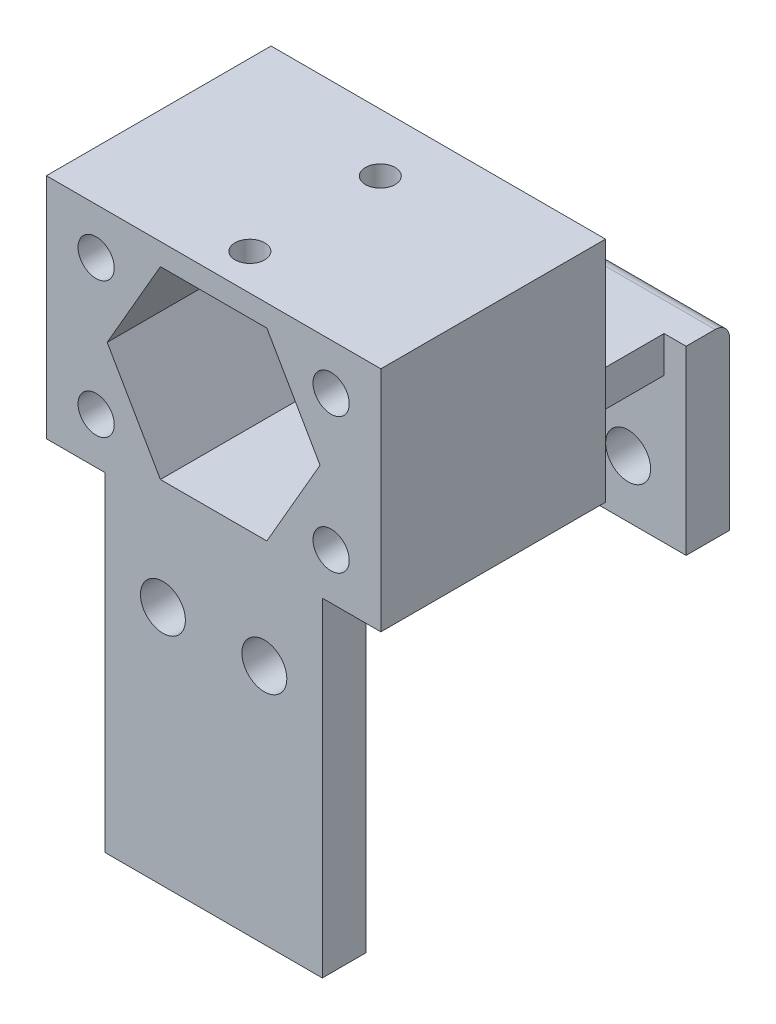
ISO-10303-21;
HEADER;
FILE_DESCRIPTION(('STEP AP214'),'2;1');
FILE_NAME('part.step','',(''),(''),'','','');
FILE_SCHEMA(('AUTOMOTIVE_DESIGN { 1 0 10303 214 1 1 1 1 }'));
ENDSEC;
DATA;
#1=APPLICATION_CONTEXT('core data for automotive mechanical design processes');
#2=APPLICATION_PROTOCOL_DEFINITION('international standard','automotive_design',2000,#1);
#3=PRODUCT_CONTEXT('',#1,'mechanical');
#4=PRODUCT('Part','Part','',(#3));
#5=PRODUCT_RELATED_PRODUCT_CATEGORY('part','',(#4));
#6=PRODUCT_DEFINITION_FORMATION('','',#4);
#7=PRODUCT_DEFINITION_CONTEXT('part definition',#1,'design');
#8=PRODUCT_DEFINITION('design','',#6,#7);
#9=PRODUCT_DEFINITION_SHAPE('','',#8);
#10=(LENGTH_UNIT() NAMED_UNIT(*) SI_UNIT(.MILLI.,.METRE.));
#11=(NAMED_UNIT(*) PLANE_ANGLE_UNIT() SI_UNIT($,.RADIAN.));
#12=(NAMED_UNIT(*) SI_UNIT($,.STERADIAN.) SOLID_ANGLE_UNIT());
#13=UNCERTAINTY_MEASURE_WITH_UNIT(LENGTH_MEASURE(1.E-05),#10,'distance_accuracy_value','');
#14=(GEOMETRIC_REPRESENTATION_CONTEXT(3) GLOBAL_UNCERTAINTY_ASSIGNED_CONTEXT((#13)) GLOBAL_UNIT_ASSIGNED_CONTEXT((#10,
#11,#12)) REPRESENTATION_CONTEXT('',''));
#15=CARTESIAN_POINT('',(0.,0.,0.));
#16=DIRECTION('',(0.,0.,1.));
#17=DIRECTION('',(1.,0.,0.));
#18=AXIS2_PLACEMENT_3D('',#15,#16,#17);
#19=CARTESIAN_POINT('',(0.,0.,-1.5));
#20=DIRECTION('',(0.,0.,-1.));
#21=DIRECTION('',(-1.,0.,0.));
#22=AXIS2_PLACEMENT_3D('',#19,#20,#21);
#23=PLANE('',#22);
#24=CARTESIAN_POINT('',(-8.10599777942234,-4.68,-1.5));
#25=DIRECTION('',(0.,0.,-1.));
#26=DIRECTION('',(-1.,0.,0.));
#27=AXIS2_PLACEMENT_3D('',#24,#25,#26);
#28=CIRCLE('',#27,1.24999999999999);
#29=CARTESIAN_POINT('',(-9.35599777942234,-4.68,-1.5));
#30=VERTEX_POINT('',#29);
#31=EDGE_CURVE('E260',#30,#30,#28,.F.);
#32=ORIENTED_EDGE('',*,*,#31,.T.);
#33=EDGE_LOOP('',(#32));
#34=FACE_BOUND('',#33,.T.);
#35=CARTESIAN_POINT('',(8.10599777942235,-4.68,-1.5));
#36=DIRECTION('',(0.,0.,-1.));
#37=DIRECTION('',(-1.,0.,0.));
#38=AXIS2_PLACEMENT_3D('',#35,#36,#37);
#39=CIRCLE('',#38,1.24999999999999);
#40=CARTESIAN_POINT('',(6.85599777942235,-4.68,-1.5));
#41=VERTEX_POINT('',#40);
#42=EDGE_CURVE('E276',#41,#41,#39,.F.);
#43=ORIENTED_EDGE('',*,*,#42,.T.);
#44=EDGE_LOOP('',(#43));
#45=FACE_BOUND('',#44,.T.);
#46=CARTESIAN_POINT('',(0.,0.,-1.5));
#47=DIRECTION('',(0.,0.,-1.));
#48=DIRECTION('',(-1.,0.,0.));
#49=AXIS2_PLACEMENT_3D('',#46,#47,#48);
#50=CIRCLE('',#49,4.75);
#51=CARTESIAN_POINT('',(-4.75,0.,-1.5));
#52=VERTEX_POINT('',#51);
#53=EDGE_CURVE('E452',#52,#52,#50,.T.);
#54=ORIENTED_EDGE('',*,*,#53,.F.);
#55=EDGE_LOOP('',(#54));
#56=FACE_BOUND('',#55,.T.);
#57=CARTESIAN_POINT('',(8.10599777942234,4.68,-1.5));
#58=DIRECTION('',(0.,0.,-1.));
#59=DIRECTION('',(-1.,0.,0.));
#60=AXIS2_PLACEMENT_3D('',#57,#58,#59);
#61=CIRCLE('',#60,1.24999999999999);
#62=CARTESIAN_POINT('',(6.85599777942235,4.68,-1.5));
#63=VERTEX_POINT('',#62);
#64=EDGE_CURVE('E268',#63,#63,#61,.F.);
#65=ORIENTED_EDGE('',*,*,#64,.T.);
#66=EDGE_LOOP('',(#65));
#67=FACE_BOUND('',#66,.T.);
#68=CARTESIAN_POINT('',(-8.10599777942235,4.68,-1.5));
#69=DIRECTION('',(0.,0.,-1.));
#70=DIRECTION('',(-1.,0.,0.));
#71=AXIS2_PLACEMENT_3D('',#68,#69,#70);
#72=CIRCLE('',#71,1.24999999999999);
#73=CARTESIAN_POINT('',(-9.35599777942234,4.68,-1.5));
#74=VERTEX_POINT('',#73);
#75=EDGE_CURVE('E252',#74,#74,#72,.F.);
#76=ORIENTED_EDGE('',*,*,#75,.T.);
#77=EDGE_LOOP('',(#76));
#78=FACE_BOUND('',#77,.T.);
#79=DIRECTION('',(-1.,0.,0.));
#80=VECTOR('',#79,1.);
#81=CARTESIAN_POINT('',(11.5379731158305,-7.86,-1.5));
#82=LINE('',#81,#80);
#83=CARTESIAN_POINT('',(11.5379731158305,-7.86,-1.5));
#84=VERTEX_POINT('',#83);
#85=CARTESIAN_POINT('',(5.98134878880452,-7.86,-1.5));
#86=VERTEX_POINT('',#85);
#87=EDGE_CURVE('E292',#84,#86,#82,.T.);
#88=ORIENTED_EDGE('',*,*,#87,.T.);
#89=DIRECTION('',(0.,-1.,0.));
#90=VECTOR('',#89,1.);
#91=CARTESIAN_POINT('',(5.98134878880452,-5.36,-1.5));
#92=LINE('',#91,#90);
#93=CARTESIAN_POINT('',(5.98134878880452,-5.36,-1.5));
#94=VERTEX_POINT('',#93);
#95=EDGE_CURVE('E238',#94,#86,#92,.T.);
#96=ORIENTED_EDGE('',*,*,#95,.F.);
#97=DIRECTION('',(1.,0.,0.));
#98=VECTOR('',#97,1.);
#99=CARTESIAN_POINT('',(5.98134878880452,-5.36,-1.5));
#100=LINE('',#99,#98);
#101=CARTESIAN_POINT('',(-5.98134878880452,-5.36,-1.5));
#102=VERTEX_POINT('',#101);
#103=EDGE_CURVE('E394',#102,#94,#100,.T.);
#104=ORIENTED_EDGE('',*,*,#103,.F.);
#105=DIRECTION('',(0.500000000000001,-0.866025403784438,0.));
#106=VECTOR('',#105,1.);
#107=CARTESIAN_POINT('',(-9.07594623166092,0.,-1.5));
#108=LINE('',#107,#106);
#109=CARTESIAN_POINT('',(-4.53797311583046,-7.86,-1.5));
#110=VERTEX_POINT('',#109);
#111=EDGE_CURVE('E286',#102,#110,#108,.T.);
#112=ORIENTED_EDGE('',*,*,#111,.T.);
#113=DIRECTION('',(-1.,0.,0.));
#114=VECTOR('',#113,1.);
#115=CARTESIAN_POINT('',(-4.53797311583046,-7.86,-1.5));
#116=LINE('',#115,#114);
#117=CARTESIAN_POINT('',(-11.5379731158305,-7.86,-1.5));
#118=VERTEX_POINT('',#117);
#119=EDGE_CURVE('E281',#110,#118,#116,.T.);
#120=ORIENTED_EDGE('',*,*,#119,.T.);
#121=DIRECTION('',(0.,1.,0.));
#122=VECTOR('',#121,1.);
#123=CARTESIAN_POINT('',(-11.5379731158305,-7.86,-1.5));
#124=LINE('',#123,#122);
#125=CARTESIAN_POINT('',(-11.5379731158305,7.86,-1.5));
#126=VERTEX_POINT('',#125);
#127=EDGE_CURVE('E280',#118,#126,#124,.T.);
#128=ORIENTED_EDGE('',*,*,#127,.T.);
#129=DIRECTION('',(1.,0.,0.));
#130=VECTOR('',#129,1.);
#131=CARTESIAN_POINT('',(-4.53797311583046,7.86,-1.5));
#132=LINE('',#131,#130);
#133=CARTESIAN_POINT('',(11.5379731158305,7.86,-1.5));
#134=VERTEX_POINT('',#133);
#135=EDGE_CURVE('E456',#126,#134,#132,.T.);
#136=ORIENTED_EDGE('',*,*,#135,.T.);
#137=DIRECTION('',(0.,-1.,0.));
#138=VECTOR('',#137,1.);
#139=CARTESIAN_POINT('',(11.5379731158305,7.86,-1.5));
#140=LINE('',#139,#138);
#141=EDGE_CURVE('E285',#134,#84,#140,.T.);
#142=ORIENTED_EDGE('',*,*,#141,.T.);
#143=EDGE_LOOP('',(#88,#96,#104,#112,#120,#128,#136,#142));
#144=FACE_BOUND('',#143,.T.);
#145=ADVANCED_FACE('F45',(#34,#45,#56,#67,#78,#144),#23,.T.);
#146=CARTESIAN_POINT('',(0.,0.,-11.1));
#147=DIRECTION('',(0.,0.,1.));
#148=DIRECTION('',(1.,0.,0.));
#149=AXIS2_PLACEMENT_3D('',#146,#147,#148);
#150=PLANE('',#149);
#151=CARTESIAN_POINT('',(3.5,-13.91,-11.1));
#152=DIRECTION('',(0.,0.,1.));
#153=DIRECTION('',(1.,0.,0.));
#154=AXIS2_PLACEMENT_3D('',#151,#152,#153);
#155=CIRCLE('',#154,1.55);
#156=CARTESIAN_POINT('',(5.05,-13.91,-11.1));
#157=VERTEX_POINT('',#156);
#158=EDGE_CURVE('E338',#157,#157,#155,.T.);
#159=ORIENTED_EDGE('',*,*,#158,.F.);
#160=EDGE_LOOP('',(#159));
#161=FACE_BOUND('',#160,.T.);
#162=CARTESIAN_POINT('',(-3.5,-13.91,-11.1));
#163=DIRECTION('',(0.,0.,1.));
#164=DIRECTION('',(1.,0.,0.));
#165=AXIS2_PLACEMENT_3D('',#162,#163,#164);
#166=CIRCLE('',#165,1.55);
#167=CARTESIAN_POINT('',(-1.95,-13.91,-11.1));
#168=VERTEX_POINT('',#167);
#169=EDGE_CURVE('E362',#168,#168,#166,.T.);
#170=ORIENTED_EDGE('',*,*,#169,.F.);
#171=EDGE_LOOP('',(#170));
#172=FACE_BOUND('',#171,.T.);
#173=DIRECTION('',(0.,1.,0.));
#174=VECTOR('',#173,1.);
#175=CARTESIAN_POINT('',(5.98134878880452,-5.36,-11.1));
#176=LINE('',#175,#174);
#177=CARTESIAN_POINT('',(5.98134878880452,-7.86,-11.1));
#178=VERTEX_POINT('',#177);
#179=CARTESIAN_POINT('',(5.98134878880452,-5.36,-11.1));
#180=VERTEX_POINT('',#179);
#181=EDGE_CURVE('E239',#178,#180,#176,.T.);
#182=ORIENTED_EDGE('',*,*,#181,.F.);
#183=DIRECTION('',(1.,0.,0.));
#184=VECTOR('',#183,1.);
#185=CARTESIAN_POINT('',(0.,-7.86,-11.1));
#186=LINE('',#185,#184);
#187=CARTESIAN_POINT('',(-4.53797311583046,-7.86,-11.1));
#188=VERTEX_POINT('',#187);
#189=EDGE_CURVE('E61',#188,#178,#186,.T.);
#190=ORIENTED_EDGE('',*,*,#189,.F.);
#191=DIRECTION('',(0.5,-0.866025403784438,0.));
#192=VECTOR('',#191,1.);
#193=CARTESIAN_POINT('',(-6.80695967374569,-3.93,-11.1));
#194=LINE('',#193,#192);
#195=CARTESIAN_POINT('',(-5.98134878880452,-5.36,-11.1));
#196=VERTEX_POINT('',#195);
#197=EDGE_CURVE('E376',#196,#188,#194,.T.);
#198=ORIENTED_EDGE('',*,*,#197,.F.);
#199=DIRECTION('',(-1.,0.,0.));
#200=VECTOR('',#199,1.);
#201=CARTESIAN_POINT('',(0.,-5.36,-11.1));
#202=LINE('',#201,#200);
#203=CARTESIAN_POINT('',(-7.5,-5.36,-11.1));
#204=VERTEX_POINT('',#203);
#205=EDGE_CURVE('E380',#196,#204,#202,.T.);
#206=ORIENTED_EDGE('',*,*,#205,.T.);
#207=DIRECTION('',(0.,1.,0.));
#208=VECTOR('',#207,1.);
#209=CARTESIAN_POINT('',(-7.5,0.,-11.1));
#210=LINE('',#209,#208);
#211=CARTESIAN_POINT('',(-7.5,-17.86,-11.1));
#212=VERTEX_POINT('',#211);
#213=EDGE_CURVE('E384',#212,#204,#210,.T.);
#214=ORIENTED_EDGE('',*,*,#213,.F.);
#215=DIRECTION('',(1.,0.,0.));
#216=VECTOR('',#215,1.);
#217=CARTESIAN_POINT('',(0.,-17.86,-11.1));
#218=LINE('',#217,#216);
#219=CARTESIAN_POINT('',(7.5,-17.86,-11.1));
#220=VERTEX_POINT('',#219);
#221=EDGE_CURVE('E344',#212,#220,#218,.T.);
#222=ORIENTED_EDGE('',*,*,#221,.T.);
#223=DIRECTION('',(0.,-1.,0.));
#224=VECTOR('',#223,1.);
#225=CARTESIAN_POINT('',(7.5,0.,-11.1));
#226=LINE('',#225,#224);
#227=CARTESIAN_POINT('',(7.5,-5.36,-11.1));
#228=VERTEX_POINT('',#227);
#229=EDGE_CURVE('E366',#228,#220,#226,.T.);
#230=ORIENTED_EDGE('',*,*,#229,.F.);
#231=DIRECTION('',(1.,0.,0.));
#232=VECTOR('',#231,1.);
#233=CARTESIAN_POINT('',(0.,-5.36,-11.1));
#234=LINE('',#233,#232);
#235=EDGE_CURVE('E370',#180,#228,#234,.T.);
#236=ORIENTED_EDGE('',*,*,#235,.F.);
#237=EDGE_LOOP('',(#182,#190,#198,#206,#214,#222,#230,#236));
#238=FACE_BOUND('',#237,.T.);
#239=ADVANCED_FACE('F558',(#161,#172,#238),#150,.T.);
#240=CARTESIAN_POINT('',(4.53797311583045,7.86,14.));
#241=DIRECTION('',(0.,-1.,0.));
#242=DIRECTION('',(1.,0.,0.));
#243=AXIS2_PLACEMENT_3D('',#240,#241,#242);
#244=PLANE('',#243);
#245=ORIENTED_EDGE('',*,*,#135,.F.);
#246=DIRECTION('',(0.,0.,1.));
#247=VECTOR('',#246,1.);
#248=CARTESIAN_POINT('',(-11.5379731158305,7.86,9.));
#249=LINE('',#248,#247);
#250=CARTESIAN_POINT('',(-11.5379731158305,7.86,14.));
#251=VERTEX_POINT('',#250);
#252=EDGE_CURVE('E314',#126,#251,#249,.T.);
#253=ORIENTED_EDGE('',*,*,#252,.T.);
#254=DIRECTION('',(-1.,0.,0.));
#255=VECTOR('',#254,1.);
#256=CARTESIAN_POINT('',(4.53797311583045,7.86,14.));
#257=LINE('',#256,#255);
#258=CARTESIAN_POINT('',(11.5379731158305,7.86,14.));
#259=VERTEX_POINT('',#258);
#260=EDGE_CURVE('E524',#259,#251,#257,.T.);
#261=ORIENTED_EDGE('',*,*,#260,.F.);
#262=DIRECTION('',(0.,0.,1.));
#263=VECTOR('',#262,1.);
#264=CARTESIAN_POINT('',(11.5379731158305,7.86,9.));
#265=LINE('',#264,#263);
#266=EDGE_CURVE('E303',#134,#259,#265,.T.);
#267=ORIENTED_EDGE('',*,*,#266,.F.);
#268=EDGE_LOOP('',(#245,#253,#261,#267));
#269=FACE_BOUND('',#268,.T.);
#270=CARTESIAN_POINT('',(0.,7.86,11.5));
#271=DIRECTION('',(0.,1.,0.));
#272=DIRECTION('',(0.,0.,1.));
#273=AXIS2_PLACEMENT_3D('',#270,#271,#272);
#274=CIRCLE('',#273,1.025);
#275=CARTESIAN_POINT('',(0.,7.86,12.525));
#276=VERTEX_POINT('',#275);
#277=EDGE_CURVE('E330',#276,#276,#274,.T.);
#278=ORIENTED_EDGE('',*,*,#277,.F.);
#279=EDGE_LOOP('',(#278));
#280=FACE_BOUND('',#279,.T.);
#281=CARTESIAN_POINT('',(0.,7.86,2.5));
#282=DIRECTION('',(0.,1.,0.));
#283=DIRECTION('',(0.,0.,1.));
#284=AXIS2_PLACEMENT_3D('',#281,#282,#283);
#285=CIRCLE('',#284,1.025);
#286=CARTESIAN_POINT('',(0.,7.86,3.525));
#287=VERTEX_POINT('',#286);
#288=EDGE_CURVE('E319',#287,#287,#285,.T.);
#289=ORIENTED_EDGE('',*,*,#288,.F.);
#290=EDGE_LOOP('',(#289));
#291=FACE_BOUND('',#290,.T.);
#292=ADVANCED_FACE('F593',(#269,#280,#291),#244,.F.);
#293=CARTESIAN_POINT('',(-9.07594623166092,0.,14.));
#294=DIRECTION('',(0.866025403784438,0.5,0.));
#295=DIRECTION('',(-0.5,0.866025403784438,0.));
#296=AXIS2_PLACEMENT_3D('',#293,#294,#295);
#297=PLANE('',#296);
#298=DIRECTION('',(0.,0.,-1.));
#299=VECTOR('',#298,1.);
#300=CARTESIAN_POINT('',(-4.53797311583046,-7.86,14.));
#301=LINE('',#300,#299);
#302=EDGE_CURVE('E527',#110,#188,#301,.T.);
#303=ORIENTED_EDGE('',*,*,#302,.F.);
#304=ORIENTED_EDGE('',*,*,#111,.F.);
#305=DIRECTION('',(0.,0.,1.));
#306=VECTOR('',#305,1.);
#307=CARTESIAN_POINT('',(-5.98134878880452,-5.36,-26.3211346990913));
#308=LINE('',#307,#306);
#309=EDGE_CURVE('E409',#196,#102,#308,.T.);
#310=ORIENTED_EDGE('',*,*,#309,.F.);
#311=ORIENTED_EDGE('',*,*,#197,.T.);
#312=EDGE_LOOP('',(#303,#304,#310,#311));
#313=FACE_BOUND('',#312,.T.);
#314=ADVANCED_FACE('F591',(#313),#297,.F.);
#315=CARTESIAN_POINT('',(-4.53797311583046,-7.86,14.));
#316=DIRECTION('',(0.,1.,0.));
#317=DIRECTION('',(-1.,0.,0.));
#318=AXIS2_PLACEMENT_3D('',#315,#316,#317);
#319=PLANE('',#318);
#320=ORIENTED_EDGE('',*,*,#119,.F.);
#321=ORIENTED_EDGE('',*,*,#302,.T.);
#322=ORIENTED_EDGE('',*,*,#189,.T.);
#323=DIRECTION('',(0.,0.,1.));
#324=VECTOR('',#323,1.);
#325=CARTESIAN_POINT('',(5.98134878880452,-7.86,-13.9867513459481));
#326=LINE('',#325,#324);
#327=EDGE_CURVE('E243',#178,#86,#326,.T.);
#328=ORIENTED_EDGE('',*,*,#327,.T.);
#329=ORIENTED_EDGE('',*,*,#87,.F.);
#330=DIRECTION('',(0.,0.,1.));
#331=VECTOR('',#330,1.);
#332=CARTESIAN_POINT('',(11.5379731158305,-7.86,9.));
#333=LINE('',#332,#331);
#334=CARTESIAN_POINT('',(11.5379731158305,-7.86,14.));
#335=VERTEX_POINT('',#334);
#336=EDGE_CURVE('E302',#84,#335,#333,.T.);
#337=ORIENTED_EDGE('',*,*,#336,.T.);
#338=DIRECTION('',(-1.,0.,0.));
#339=VECTOR('',#338,1.);
#340=CARTESIAN_POINT('',(0.,-7.86000000000001,14.));
#341=LINE('',#340,#339);
#342=CARTESIAN_POINT('',(7.5,-7.86,14.));
#343=VERTEX_POINT('',#342);
#344=EDGE_CURVE('E413',#335,#343,#341,.T.);
#345=ORIENTED_EDGE('',*,*,#344,.T.);
#346=DIRECTION('',(0.,0.,1.));
#347=VECTOR('',#346,1.);
#348=CARTESIAN_POINT('',(7.5,-7.86,11.));
#349=LINE('',#348,#347);
#350=CARTESIAN_POINT('',(7.5,-7.86,11.));
#351=VERTEX_POINT('',#350);
#352=EDGE_CURVE('E207',#351,#343,#349,.T.);
#353=ORIENTED_EDGE('',*,*,#352,.F.);
#354=DIRECTION('',(1.,0.,0.));
#355=VECTOR('',#354,1.);
#356=CARTESIAN_POINT('',(0.,-7.86,11.));
#357=LINE('',#356,#355);
#358=CARTESIAN_POINT('',(-7.5,-7.86,11.));
#359=VERTEX_POINT('',#358);
#360=EDGE_CURVE('E414',#359,#351,#357,.T.);
#361=ORIENTED_EDGE('',*,*,#360,.F.);
#362=DIRECTION('',(0.,0.,1.));
#363=VECTOR('',#362,1.);
#364=CARTESIAN_POINT('',(-7.5,-7.86,11.));
#365=LINE('',#364,#363);
#366=CARTESIAN_POINT('',(-7.5,-7.86,14.));
#367=VERTEX_POINT('',#366);
#368=EDGE_CURVE('E433',#359,#367,#365,.T.);
#369=ORIENTED_EDGE('',*,*,#368,.T.);
#370=DIRECTION('',(1.,0.,0.));
#371=VECTOR('',#370,1.);
#372=CARTESIAN_POINT('',(0.,-7.86,14.));
#373=LINE('',#372,#371);
#374=CARTESIAN_POINT('',(-11.5379731158305,-7.86,14.));
#375=VERTEX_POINT('',#374);
#376=EDGE_CURVE('E436',#375,#367,#373,.T.);
#377=ORIENTED_EDGE('',*,*,#376,.F.);
#378=DIRECTION('',(0.,0.,1.));
#379=VECTOR('',#378,1.);
#380=CARTESIAN_POINT('',(-11.5379731158305,-7.86,9.));
#381=LINE('',#380,#379);
#382=EDGE_CURVE('E315',#118,#375,#381,.T.);
#383=ORIENTED_EDGE('',*,*,#382,.F.);
#384=EDGE_LOOP('',(#320,#321,#322,#328,#329,#337,#345,#353,#361,#369,#377,#383));
#385=FACE_BOUND('',#384,.T.);
#386=ADVANCED_FACE('F573',(#385),#319,.F.);
#387=CARTESIAN_POINT('',(0.,0.,14.));
#388=DIRECTION('',(0.,0.,1.));
#389=DIRECTION('',(1.,0.,0.));
#390=AXIS2_PLACEMENT_3D('',#387,#388,#389);
#391=PLANE('',#390);
#392=CARTESIAN_POINT('',(-8.10599777942235,4.68,14.));
#393=DIRECTION('',(0.,0.,1.));
#394=DIRECTION('',(1.,0.,0.));
#395=AXIS2_PLACEMENT_3D('',#392,#393,#394);
#396=CIRCLE('',#395,1.24999999999999);
#397=CARTESIAN_POINT('',(-6.85599777942236,4.68,14.));
#398=VERTEX_POINT('',#397);
#399=EDGE_CURVE('E242',#398,#398,#396,.T.);
#400=ORIENTED_EDGE('',*,*,#399,.F.);
#401=EDGE_LOOP('',(#400));
#402=FACE_BOUND('',#401,.T.);
#403=CARTESIAN_POINT('',(-8.10599777942234,-4.68,14.));
#404=DIRECTION('',(0.,0.,1.));
#405=DIRECTION('',(1.,0.,0.));
#406=AXIS2_PLACEMENT_3D('',#403,#404,#405);
#407=CIRCLE('',#406,1.24999999999999);
#408=CARTESIAN_POINT('',(-6.85599777942235,-4.68,14.));
#409=VERTEX_POINT('',#408);
#410=EDGE_CURVE('E256',#409,#409,#407,.T.);
#411=ORIENTED_EDGE('',*,*,#410,.F.);
#412=EDGE_LOOP('',(#411));
#413=FACE_BOUND('',#412,.T.);
#414=CARTESIAN_POINT('',(8.10599777942234,4.68,14.));
#415=DIRECTION('',(0.,0.,1.));
#416=DIRECTION('',(1.,0.,0.));
#417=AXIS2_PLACEMENT_3D('',#414,#415,#416);
#418=CIRCLE('',#417,1.24999999999999);
#419=CARTESIAN_POINT('',(9.35599777942233,4.68,14.));
#420=VERTEX_POINT('',#419);
#421=EDGE_CURVE('E264',#420,#420,#418,.T.);
#422=ORIENTED_EDGE('',*,*,#421,.F.);
#423=EDGE_LOOP('',(#422));
#424=FACE_BOUND('',#423,.T.);
#425=CARTESIAN_POINT('',(8.10599777942235,-4.68,14.));
#426=DIRECTION('',(0.,0.,1.));
#427=DIRECTION('',(1.,0.,0.));
#428=AXIS2_PLACEMENT_3D('',#425,#426,#427);
#429=CIRCLE('',#428,1.24999999999999);
#430=CARTESIAN_POINT('',(9.35599777942234,-4.68,14.));
#431=VERTEX_POINT('',#430);
#432=EDGE_CURVE('E272',#431,#431,#429,.T.);
#433=ORIENTED_EDGE('',*,*,#432,.F.);
#434=EDGE_LOOP('',(#433));
#435=FACE_BOUND('',#434,.T.);
#436=DIRECTION('',(0.,1.,0.));
#437=VECTOR('',#436,1.);
#438=CARTESIAN_POINT('',(11.5379731158305,7.86,14.));
#439=LINE('',#438,#437);
#440=EDGE_CURVE('E296',#335,#259,#439,.T.);
#441=ORIENTED_EDGE('',*,*,#440,.T.);
#442=ORIENTED_EDGE('',*,*,#260,.T.);
#443=DIRECTION('',(0.,-1.,0.));
#444=VECTOR('',#443,1.);
#445=CARTESIAN_POINT('',(-11.5379731158305,7.86,14.));
#446=LINE('',#445,#444);
#447=EDGE_CURVE('E307',#251,#375,#446,.T.);
#448=ORIENTED_EDGE('',*,*,#447,.T.);
#449=ORIENTED_EDGE('',*,*,#376,.T.);
#450=DIRECTION('',(0.,1.,0.));
#451=VECTOR('',#450,1.);
#452=CARTESIAN_POINT('',(-7.5,0.,14.));
#453=LINE('',#452,#451);
#454=CARTESIAN_POINT('',(-7.5,-30.56,14.));
#455=VERTEX_POINT('',#454);
#456=EDGE_CURVE('E212',#455,#367,#453,.T.);
#457=ORIENTED_EDGE('',*,*,#456,.F.);
#458=DIRECTION('',(-1.,0.,0.));
#459=VECTOR('',#458,1.);
#460=CARTESIAN_POINT('',(7.5,-30.56,14.));
#461=LINE('',#460,#459);
#462=CARTESIAN_POINT('',(7.5,-30.56,14.));
#463=VERTEX_POINT('',#462);
#464=EDGE_CURVE('E215',#463,#455,#461,.T.);
#465=ORIENTED_EDGE('',*,*,#464,.F.);
#466=DIRECTION('',(0.,-1.,0.));
#467=VECTOR('',#466,1.);
#468=CARTESIAN_POINT('',(7.5,0.,14.));
#469=LINE('',#468,#467);
#470=EDGE_CURVE('E200',#343,#463,#469,.T.);
#471=ORIENTED_EDGE('',*,*,#470,.F.);
#472=ORIENTED_EDGE('',*,*,#344,.F.);
#473=EDGE_LOOP('',(#441,#442,#448,#449,#457,#465,#471,#472));
#474=FACE_BOUND('',#473,.T.);
#475=DIRECTION('',(-0.5,0.866025403784439,0.));
#476=VECTOR('',#475,1.);
#477=CARTESIAN_POINT('',(7.34389542409204,0.,14.));
#478=LINE('',#477,#476);
#479=CARTESIAN_POINT('',(7.34389542409204,0.,14.));
#480=VERTEX_POINT('',#479);
#481=CARTESIAN_POINT('',(3.67194771204602,6.36,14.));
#482=VERTEX_POINT('',#481);
#483=EDGE_CURVE('E466',#480,#482,#478,.T.);
#484=ORIENTED_EDGE('',*,*,#483,.F.);
#485=DIRECTION('',(0.5,0.866025403784439,0.));
#486=VECTOR('',#485,1.);
#487=CARTESIAN_POINT('',(3.67194771204602,-6.36,14.));
#488=LINE('',#487,#486);
#489=CARTESIAN_POINT('',(3.67194771204602,-6.36,14.));
#490=VERTEX_POINT('',#489);
#491=EDGE_CURVE('E463',#490,#480,#488,.T.);
#492=ORIENTED_EDGE('',*,*,#491,.F.);
#493=DIRECTION('',(1.,0.,0.));
#494=VECTOR('',#493,1.);
#495=CARTESIAN_POINT('',(-3.67194771204602,-6.36,14.));
#496=LINE('',#495,#494);
#497=CARTESIAN_POINT('',(-3.67194771204602,-6.36,14.));
#498=VERTEX_POINT('',#497);
#499=EDGE_CURVE('E480',#498,#490,#496,.T.);
#500=ORIENTED_EDGE('',*,*,#499,.F.);
#501=DIRECTION('',(0.5,-0.866025403784438,0.));
#502=VECTOR('',#501,1.);
#503=CARTESIAN_POINT('',(-7.34389542409204,0.,14.));
#504=LINE('',#503,#502);
#505=CARTESIAN_POINT('',(-7.34389542409204,0.,14.));
#506=VERTEX_POINT('',#505);
#507=EDGE_CURVE('E476',#506,#498,#504,.T.);
#508=ORIENTED_EDGE('',*,*,#507,.F.);
#509=DIRECTION('',(-0.5,-0.866025403784439,0.));
#510=VECTOR('',#509,1.);
#511=CARTESIAN_POINT('',(-3.67194771204602,6.36,14.));
#512=LINE('',#511,#510);
#513=CARTESIAN_POINT('',(-3.67194771204602,6.36,14.));
#514=VERTEX_POINT('',#513);
#515=EDGE_CURVE('E473',#514,#506,#512,.T.);
#516=ORIENTED_EDGE('',*,*,#515,.F.);
#517=DIRECTION('',(-1.,0.,0.));
#518=VECTOR('',#517,1.);
#519=CARTESIAN_POINT('',(3.67194771204602,6.36,14.));
#520=LINE('',#519,#518);
#521=EDGE_CURVE('E470',#482,#514,#520,.T.);
#522=ORIENTED_EDGE('',*,*,#521,.F.);
#523=EDGE_LOOP('',(#484,#492,#500,#508,#516,#522));
#524=FACE_BOUND('',#523,.T.);
#525=CARTESIAN_POINT('',(3.5,-13.91,14.));
#526=DIRECTION('',(0.,0.,1.));
#527=DIRECTION('',(1.,0.,0.));
#528=AXIS2_PLACEMENT_3D('',#525,#526,#527);
#529=CIRCLE('',#528,1.55);
#530=CARTESIAN_POINT('',(5.05,-13.91,14.));
#531=VERTEX_POINT('',#530);
#532=EDGE_CURVE('E211',#531,#531,#529,.T.);
#533=ORIENTED_EDGE('',*,*,#532,.F.);
#534=EDGE_LOOP('',(#533));
#535=FACE_BOUND('',#534,.T.);
#536=CARTESIAN_POINT('',(-3.5,-13.91,14.));
#537=DIRECTION('',(0.,0.,1.));
#538=DIRECTION('',(1.,0.,0.));
#539=AXIS2_PLACEMENT_3D('',#536,#537,#538);
#540=CIRCLE('',#539,1.55);
#541=CARTESIAN_POINT('',(-1.95,-13.91,14.));
#542=VERTEX_POINT('',#541);
#543=EDGE_CURVE('E418',#542,#542,#540,.T.);
#544=ORIENTED_EDGE('',*,*,#543,.F.);
#545=EDGE_LOOP('',(#544));
#546=FACE_BOUND('',#545,.T.);
#547=ADVANCED_FACE('F217',(#402,#413,#424,#435,#474,#524,#535,#546),#391,.T.);
#548=CARTESIAN_POINT('',(3.67194771204602,-6.36,14.));
#549=DIRECTION('',(-0.866025403784439,0.5,0.));
#550=DIRECTION('',(-0.5,-0.866025403784439,0.));
#551=AXIS2_PLACEMENT_3D('',#548,#549,#550);
#552=PLANE('',#551);
#553=DIRECTION('',(0.5,0.866025403784439,0.));
#554=VECTOR('',#553,1.);
#555=CARTESIAN_POINT('',(3.67194771204602,-6.36,0.));
#556=LINE('',#555,#554);
#557=CARTESIAN_POINT('',(3.67194771204602,-6.36,0.));
#558=VERTEX_POINT('',#557);
#559=CARTESIAN_POINT('',(7.34389542409204,0.,0.));
#560=VERTEX_POINT('',#559);
#561=EDGE_CURVE('E462',#558,#560,#556,.T.);
#562=ORIENTED_EDGE('',*,*,#561,.F.);
#563=DIRECTION('',(0.,0.,-1.));
#564=VECTOR('',#563,1.);
#565=CARTESIAN_POINT('',(3.67194771204602,-6.36,14.));
#566=LINE('',#565,#564);
#567=EDGE_CURVE('E483',#490,#558,#566,.T.);
#568=ORIENTED_EDGE('',*,*,#567,.F.);
#569=ORIENTED_EDGE('',*,*,#491,.T.);
#570=DIRECTION('',(0.,0.,-1.));
#571=VECTOR('',#570,1.);
#572=CARTESIAN_POINT('',(7.34389542409204,0.,14.));
#573=LINE('',#572,#571);
#574=EDGE_CURVE('E520',#480,#560,#573,.T.);
#575=ORIENTED_EDGE('',*,*,#574,.T.);
#576=EDGE_LOOP('',(#562,#568,#569,#575));
#577=FACE_BOUND('',#576,.T.);
#578=ADVANCED_FACE('F637',(#577),#552,.T.);
#579=CARTESIAN_POINT('',(7.34389542409204,0.,14.));
#580=DIRECTION('',(-0.866025403784438,-0.5,0.));
#581=DIRECTION('',(0.5,-0.866025403784439,0.));
#582=AXIS2_PLACEMENT_3D('',#579,#580,#581);
#583=PLANE('',#582);
#584=DIRECTION('',(-0.5,0.866025403784439,0.));
#585=VECTOR('',#584,1.);
#586=CARTESIAN_POINT('',(7.34389542409204,0.,0.));
#587=LINE('',#586,#585);
#588=CARTESIAN_POINT('',(3.67194771204602,6.36,0.));
#589=VERTEX_POINT('',#588);
#590=EDGE_CURVE('E487',#560,#589,#587,.T.);
#591=ORIENTED_EDGE('',*,*,#590,.F.);
#592=ORIENTED_EDGE('',*,*,#574,.F.);
#593=ORIENTED_EDGE('',*,*,#483,.T.);
#594=DIRECTION('',(0.,0.,-1.));
#595=VECTOR('',#594,1.);
#596=CARTESIAN_POINT('',(3.67194771204602,6.36,14.));
#597=LINE('',#596,#595);
#598=EDGE_CURVE('E517',#482,#589,#597,.T.);
#599=ORIENTED_EDGE('',*,*,#598,.T.);
#600=EDGE_LOOP('',(#591,#592,#593,#599));
#601=FACE_BOUND('',#600,.T.);
#602=ADVANCED_FACE('F633',(#601),#583,.T.);
#603=CARTESIAN_POINT('',(3.67194771204602,6.36,14.));
#604=DIRECTION('',(0.,-1.,0.));
#605=DIRECTION('',(1.,0.,0.));
#606=AXIS2_PLACEMENT_3D('',#603,#604,#605);
#607=PLANE('',#606);
#608=CARTESIAN_POINT('',(0.,6.36,2.5));
#609=DIRECTION('',(0.,-1.,0.));
#610=DIRECTION('',(1.,0.,0.));
#611=AXIS2_PLACEMENT_3D('',#608,#609,#610);
#612=CIRCLE('',#611,1.025);
#613=CARTESIAN_POINT('',(1.025,6.36,2.5));
#614=VERTEX_POINT('',#613);
#615=EDGE_CURVE('E326',#614,#614,#612,.T.);
#616=ORIENTED_EDGE('',*,*,#615,.F.);
#617=EDGE_LOOP('',(#616));
#618=FACE_BOUND('',#617,.T.);
#619=CARTESIAN_POINT('',(0.,6.36,11.5));
#620=DIRECTION('',(0.,-1.,0.));
#621=DIRECTION('',(1.,0.,0.));
#622=AXIS2_PLACEMENT_3D('',#619,#620,#621);
#623=CIRCLE('',#622,1.025);
#624=CARTESIAN_POINT('',(1.025,6.36,11.5));
#625=VERTEX_POINT('',#624);
#626=EDGE_CURVE('E334',#625,#625,#623,.T.);
#627=ORIENTED_EDGE('',*,*,#626,.F.);
#628=EDGE_LOOP('',(#627));
#629=FACE_BOUND('',#628,.T.);
#630=DIRECTION('',(-1.,0.,0.));
#631=VECTOR('',#630,1.);
#632=CARTESIAN_POINT('',(3.67194771204602,6.36,0.));
#633=LINE('',#632,#631);
#634=CARTESIAN_POINT('',(-3.67194771204602,6.36,0.));
#635=VERTEX_POINT('',#634);
#636=EDGE_CURVE('E491',#589,#635,#633,.T.);
#637=ORIENTED_EDGE('',*,*,#636,.F.);
#638=ORIENTED_EDGE('',*,*,#598,.F.);
#639=ORIENTED_EDGE('',*,*,#521,.T.);
#640=DIRECTION('',(0.,0.,-1.));
#641=VECTOR('',#640,1.);
#642=CARTESIAN_POINT('',(-3.67194771204602,6.36,14.));
#643=LINE('',#642,#641);
#644=EDGE_CURVE('E514',#514,#635,#643,.T.);
#645=ORIENTED_EDGE('',*,*,#644,.T.);
#646=EDGE_LOOP('',(#637,#638,#639,#645));
#647=FACE_BOUND('',#646,.T.);
#648=ADVANCED_FACE('F629',(#618,#629,#647),#607,.T.);
#649=CARTESIAN_POINT('',(-3.67194771204602,6.36,14.));
#650=DIRECTION('',(0.866025403784439,-0.5,0.));
#651=DIRECTION('',(0.5,0.866025403784439,0.));
#652=AXIS2_PLACEMENT_3D('',#649,#650,#651);
#653=PLANE('',#652);
#654=DIRECTION('',(-0.5,-0.866025403784439,0.));
#655=VECTOR('',#654,1.);
#656=CARTESIAN_POINT('',(-3.67194771204602,6.36,0.));
#657=LINE('',#656,#655);
#658=CARTESIAN_POINT('',(-7.34389542409204,0.,0.));
#659=VERTEX_POINT('',#658);
#660=EDGE_CURVE('E495',#635,#659,#657,.T.);
#661=ORIENTED_EDGE('',*,*,#660,.F.);
#662=ORIENTED_EDGE('',*,*,#644,.F.);
#663=ORIENTED_EDGE('',*,*,#515,.T.);
#664=DIRECTION('',(0.,0.,-1.));
#665=VECTOR('',#664,1.);
#666=CARTESIAN_POINT('',(-7.34389542409204,0.,14.));
#667=LINE('',#666,#665);
#668=EDGE_CURVE('E511',#506,#659,#667,.T.);
#669=ORIENTED_EDGE('',*,*,#668,.T.);
#670=EDGE_LOOP('',(#661,#662,#663,#669));
#671=FACE_BOUND('',#670,.T.);
#672=ADVANCED_FACE('F625',(#671),#653,.T.);
#673=CARTESIAN_POINT('',(-7.34389542409204,0.,14.));
#674=DIRECTION('',(0.866025403784438,0.5,0.));
#675=DIRECTION('',(-0.5,0.866025403784439,0.));
#676=AXIS2_PLACEMENT_3D('',#673,#674,#675);
#677=PLANE('',#676);
#678=DIRECTION('',(0.5,-0.866025403784438,0.));
#679=VECTOR('',#678,1.);
#680=CARTESIAN_POINT('',(-7.34389542409204,0.,0.));
#681=LINE('',#680,#679);
#682=CARTESIAN_POINT('',(-3.67194771204602,-6.36,0.));
#683=VERTEX_POINT('',#682);
#684=EDGE_CURVE('E499',#659,#683,#681,.T.);
#685=ORIENTED_EDGE('',*,*,#684,.F.);
#686=ORIENTED_EDGE('',*,*,#668,.F.);
#687=ORIENTED_EDGE('',*,*,#507,.T.);
#688=DIRECTION('',(0.,0.,-1.));
#689=VECTOR('',#688,1.);
#690=CARTESIAN_POINT('',(-3.67194771204602,-6.36,14.));
#691=LINE('',#690,#689);
#692=EDGE_CURVE('E508',#498,#683,#691,.T.);
#693=ORIENTED_EDGE('',*,*,#692,.T.);
#694=EDGE_LOOP('',(#685,#686,#687,#693));
#695=FACE_BOUND('',#694,.T.);
#696=ADVANCED_FACE('F621',(#695),#677,.T.);
#697=CARTESIAN_POINT('',(-3.67194771204602,-6.36,14.));
#698=DIRECTION('',(0.,1.,0.));
#699=DIRECTION('',(-1.,0.,0.));
#700=AXIS2_PLACEMENT_3D('',#697,#698,#699);
#701=PLANE('',#700);
#702=DIRECTION('',(1.,0.,0.));
#703=VECTOR('',#702,1.);
#704=CARTESIAN_POINT('',(-3.67194771204602,-6.36,0.));
#705=LINE('',#704,#703);
#706=EDGE_CURVE('E467',#683,#558,#705,.T.);
#707=ORIENTED_EDGE('',*,*,#706,.F.);
#708=ORIENTED_EDGE('',*,*,#692,.F.);
#709=ORIENTED_EDGE('',*,*,#499,.T.);
#710=ORIENTED_EDGE('',*,*,#567,.T.);
#711=EDGE_LOOP('',(#707,#708,#709,#710));
#712=FACE_BOUND('',#711,.T.);
#713=ADVANCED_FACE('F617',(#712),#701,.T.);
#714=CARTESIAN_POINT('',(0.,0.,0.));
#715=DIRECTION('',(0.,0.,-1.));
#716=DIRECTION('',(-1.,0.,0.));
#717=AXIS2_PLACEMENT_3D('',#714,#715,#716);
#718=PLANE('',#717);
#719=CARTESIAN_POINT('',(0.,0.,0.));
#720=DIRECTION('',(0.,0.,-1.));
#721=DIRECTION('',(-1.,0.,0.));
#722=AXIS2_PLACEMENT_3D('',#719,#720,#721);
#723=CIRCLE('',#722,4.75);
#724=CARTESIAN_POINT('',(-4.75,0.,0.));
#725=VERTEX_POINT('',#724);
#726=EDGE_CURVE('E449',#725,#725,#723,.T.);
#727=ORIENTED_EDGE('',*,*,#726,.T.);
#728=EDGE_LOOP('',(#727));
#729=FACE_BOUND('',#728,.T.);
#730=ORIENTED_EDGE('',*,*,#706,.T.);
#731=ORIENTED_EDGE('',*,*,#561,.T.);
#732=ORIENTED_EDGE('',*,*,#590,.T.);
#733=ORIENTED_EDGE('',*,*,#636,.T.);
#734=ORIENTED_EDGE('',*,*,#660,.T.);
#735=ORIENTED_EDGE('',*,*,#684,.T.);
#736=EDGE_LOOP('',(#730,#731,#732,#733,#734,#735));
#737=FACE_BOUND('',#736,.T.);
#738=ADVANCED_FACE('F614',(#729,#737),#718,.F.);
#739=CARTESIAN_POINT('',(0.,0.,-1.5));
#740=DIRECTION('',(0.,0.,1.));
#741=DIRECTION('',(1.,0.,0.));
#742=AXIS2_PLACEMENT_3D('',#739,#740,#741);
#743=CYLINDRICAL_SURFACE('',#742,4.75);
#744=ORIENTED_EDGE('',*,*,#53,.T.);
#745=EDGE_LOOP('',(#744));
#746=FACE_BOUND('',#745,.T.);
#747=ORIENTED_EDGE('',*,*,#726,.F.);
#748=EDGE_LOOP('',(#747));
#749=FACE_BOUND('',#748,.T.);
#750=ADVANCED_FACE('F612',(#746,#749),#743,.F.);
#751=CARTESIAN_POINT('',(7.5,0.,11.));
#752=DIRECTION('',(-1.,0.,0.));
#753=DIRECTION('',(0.,-1.,0.));
#754=AXIS2_PLACEMENT_3D('',#751,#752,#753);
#755=PLANE('',#754);
#756=ORIENTED_EDGE('',*,*,#470,.T.);
#757=DIRECTION('',(0.,0.,1.));
#758=VECTOR('',#757,1.);
#759=CARTESIAN_POINT('',(7.5,-30.56,11.));
#760=LINE('',#759,#758);
#761=CARTESIAN_POINT('',(7.5,-30.56,11.));
#762=VERTEX_POINT('',#761);
#763=EDGE_CURVE('E205',#762,#463,#760,.T.);
#764=ORIENTED_EDGE('',*,*,#763,.F.);
#765=DIRECTION('',(0.,-1.,0.));
#766=VECTOR('',#765,1.);
#767=CARTESIAN_POINT('',(7.5,0.,11.));
#768=LINE('',#767,#766);
#769=EDGE_CURVE('E422',#351,#762,#768,.T.);
#770=ORIENTED_EDGE('',*,*,#769,.F.);
#771=ORIENTED_EDGE('',*,*,#352,.T.);
#772=EDGE_LOOP('',(#756,#764,#770,#771));
#773=FACE_BOUND('',#772,.T.);
#774=ADVANCED_FACE('F202',(#773),#755,.F.);
#775=CARTESIAN_POINT('',(-7.5,0.,11.));
#776=DIRECTION('',(1.,0.,0.));
#777=DIRECTION('',(0.,1.,0.));
#778=AXIS2_PLACEMENT_3D('',#775,#776,#777);
#779=PLANE('',#778);
#780=ORIENTED_EDGE('',*,*,#456,.T.);
#781=ORIENTED_EDGE('',*,*,#368,.F.);
#782=DIRECTION('',(0.,1.,0.));
#783=VECTOR('',#782,1.);
#784=CARTESIAN_POINT('',(-7.5,0.,11.));
#785=LINE('',#784,#783);
#786=CARTESIAN_POINT('',(-7.5,-30.56,11.));
#787=VERTEX_POINT('',#786);
#788=EDGE_CURVE('E417',#787,#359,#785,.T.);
#789=ORIENTED_EDGE('',*,*,#788,.F.);
#790=DIRECTION('',(0.,0.,-1.));
#791=VECTOR('',#790,1.);
#792=CARTESIAN_POINT('',(-7.5,-30.56,14.));
#793=LINE('',#792,#791);
#794=EDGE_CURVE('E225',#455,#787,#793,.T.);
#795=ORIENTED_EDGE('',*,*,#794,.F.);
#796=EDGE_LOOP('',(#780,#781,#789,#795));
#797=FACE_BOUND('',#796,.T.);
#798=ADVANCED_FACE('F584',(#797),#779,.F.);
#799=CARTESIAN_POINT('',(3.5,-13.91,11.));
#800=DIRECTION('',(0.,0.,1.));
#801=DIRECTION('',(1.,0.,0.));
#802=AXIS2_PLACEMENT_3D('',#799,#800,#801);
#803=CYLINDRICAL_SURFACE('',#802,1.55);
#804=CARTESIAN_POINT('',(3.5,-13.91,11.));
#805=DIRECTION('',(0.,0.,1.));
#806=DIRECTION('',(1.,0.,0.));
#807=AXIS2_PLACEMENT_3D('',#804,#805,#806);
#808=CIRCLE('',#807,1.55);
#809=CARTESIAN_POINT('',(5.05,-13.91,11.));
#810=VERTEX_POINT('',#809);
#811=EDGE_CURVE('E425',#810,#810,#808,.T.);
#812=ORIENTED_EDGE('',*,*,#811,.F.);
#813=EDGE_LOOP('',(#812));
#814=FACE_BOUND('',#813,.T.);
#815=ORIENTED_EDGE('',*,*,#532,.T.);
#816=EDGE_LOOP('',(#815));
#817=FACE_BOUND('',#816,.T.);
#818=ADVANCED_FACE('F707',(#814,#817),#803,.F.);
#819=CARTESIAN_POINT('',(-3.5,-13.91,11.));
#820=DIRECTION('',(0.,0.,1.));
#821=DIRECTION('',(1.,0.,0.));
#822=AXIS2_PLACEMENT_3D('',#819,#820,#821);
#823=CYLINDRICAL_SURFACE('',#822,1.55);
#824=CARTESIAN_POINT('',(-3.5,-13.91,11.));
#825=DIRECTION('',(0.,0.,1.));
#826=DIRECTION('',(1.,0.,0.));
#827=AXIS2_PLACEMENT_3D('',#824,#825,#826);
#828=CIRCLE('',#827,1.55);
#829=CARTESIAN_POINT('',(-1.95,-13.91,11.));
#830=VERTEX_POINT('',#829);
#831=EDGE_CURVE('E429',#830,#830,#828,.T.);
#832=ORIENTED_EDGE('',*,*,#831,.F.);
#833=EDGE_LOOP('',(#832));
#834=FACE_BOUND('',#833,.T.);
#835=ORIENTED_EDGE('',*,*,#543,.T.);
#836=EDGE_LOOP('',(#835));
#837=FACE_BOUND('',#836,.T.);
#838=ADVANCED_FACE('F704',(#834,#837),#823,.F.);
#839=CARTESIAN_POINT('',(0.,0.,11.));
#840=DIRECTION('',(0.,0.,1.));
#841=DIRECTION('',(1.,0.,0.));
#842=AXIS2_PLACEMENT_3D('',#839,#840,#841);
#843=PLANE('',#842);
#844=ORIENTED_EDGE('',*,*,#788,.T.);
#845=ORIENTED_EDGE('',*,*,#360,.T.);
#846=ORIENTED_EDGE('',*,*,#769,.T.);
#847=DIRECTION('',(1.,0.,0.));
#848=VECTOR('',#847,1.);
#849=CARTESIAN_POINT('',(-7.5,-30.56,11.));
#850=LINE('',#849,#848);
#851=EDGE_CURVE('E230',#787,#762,#850,.T.);
#852=ORIENTED_EDGE('',*,*,#851,.F.);
#853=EDGE_LOOP('',(#844,#845,#846,#852));
#854=FACE_BOUND('',#853,.T.);
#855=ORIENTED_EDGE('',*,*,#811,.T.);
#856=EDGE_LOOP('',(#855));
#857=FACE_BOUND('',#856,.T.);
#858=ORIENTED_EDGE('',*,*,#831,.T.);
#859=EDGE_LOOP('',(#858));
#860=FACE_BOUND('',#859,.T.);
#861=ADVANCED_FACE('F581',(#854,#857,#860),#843,.F.);
#862=CARTESIAN_POINT('',(5.98134878880452,-5.36,-26.3211346990913));
#863=DIRECTION('',(0.,-1.,0.));
#864=DIRECTION('',(0.,0.,-1.));
#865=AXIS2_PLACEMENT_3D('',#862,#863,#864);
#866=PLANE('',#865);
#867=DIRECTION('',(0.,0.,1.));
#868=VECTOR('',#867,1.);
#869=CARTESIAN_POINT('',(7.5,-5.36,-14.1));
#870=LINE('',#869,#868);
#871=CARTESIAN_POINT('',(7.5,-5.36,-13.1));
#872=VERTEX_POINT('',#871);
#873=EDGE_CURVE('E358',#872,#228,#870,.T.);
#874=ORIENTED_EDGE('',*,*,#873,.F.);
#875=DIRECTION('',(-1.,0.,0.));
#876=VECTOR('',#875,1.);
#877=CARTESIAN_POINT('',(5.98134878880452,-5.36,-13.1));
#878=LINE('',#877,#876);
#879=CARTESIAN_POINT('',(-7.5,-5.36,-13.1));
#880=VERTEX_POINT('',#879);
#881=EDGE_CURVE('E530',#872,#880,#878,.T.);
#882=ORIENTED_EDGE('',*,*,#881,.T.);
#883=DIRECTION('',(0.,0.,1.));
#884=VECTOR('',#883,1.);
#885=CARTESIAN_POINT('',(-7.5,-5.36,-14.1));
#886=LINE('',#885,#884);
#887=EDGE_CURVE('E398',#880,#204,#886,.T.);
#888=ORIENTED_EDGE('',*,*,#887,.T.);
#889=ORIENTED_EDGE('',*,*,#205,.F.);
#890=ORIENTED_EDGE('',*,*,#309,.T.);
#891=ORIENTED_EDGE('',*,*,#103,.T.);
#892=DIRECTION('',(0.,0.,1.));
#893=VECTOR('',#892,1.);
#894=CARTESIAN_POINT('',(5.98134878880452,-5.36,-26.3211346990913));
#895=LINE('',#894,#893);
#896=EDGE_CURVE('E406',#180,#94,#895,.T.);
#897=ORIENTED_EDGE('',*,*,#896,.F.);
#898=ORIENTED_EDGE('',*,*,#235,.T.);
#899=EDGE_LOOP('',(#874,#882,#888,#889,#890,#891,#897,#898));
#900=FACE_BOUND('',#899,.T.);
#901=ADVANCED_FACE('F552',(#900),#866,.F.);
#902=CARTESIAN_POINT('',(0.,0.,-14.1));
#903=DIRECTION('',(0.,0.,1.));
#904=DIRECTION('',(1.,0.,0.));
#905=AXIS2_PLACEMENT_3D('',#902,#903,#904);
#906=PLANE('',#905);
#907=DIRECTION('',(0.,1.,0.));
#908=VECTOR('',#907,1.);
#909=CARTESIAN_POINT('',(-7.5,0.,-14.1));
#910=LINE('',#909,#908);
#911=CARTESIAN_POINT('',(-7.5,-17.86,-14.1));
#912=VERTEX_POINT('',#911);
#913=CARTESIAN_POINT('',(-7.5,-6.36,-14.1));
#914=VERTEX_POINT('',#913);
#915=EDGE_CURVE('E351',#912,#914,#910,.T.);
#916=ORIENTED_EDGE('',*,*,#915,.T.);
#917=DIRECTION('',(-1.,0.,0.));
#918=VECTOR('',#917,1.);
#919=CARTESIAN_POINT('',(0.,-6.36,-14.1));
#920=LINE('',#919,#918);
#921=CARTESIAN_POINT('',(7.5,-6.36,-14.1));
#922=VERTEX_POINT('',#921);
#923=EDGE_CURVE('E54',#914,#922,#920,.F.);
#924=ORIENTED_EDGE('',*,*,#923,.T.);
#925=DIRECTION('',(0.,-1.,0.));
#926=VECTOR('',#925,1.);
#927=CARTESIAN_POINT('',(7.5,0.,-14.1));
#928=LINE('',#927,#926);
#929=CARTESIAN_POINT('',(7.5,-17.86,-14.1));
#930=VERTEX_POINT('',#929);
#931=EDGE_CURVE('E348',#922,#930,#928,.T.);
#932=ORIENTED_EDGE('',*,*,#931,.T.);
#933=DIRECTION('',(1.,0.,0.));
#934=VECTOR('',#933,1.);
#935=CARTESIAN_POINT('',(0.,-17.86,-14.1));
#936=LINE('',#935,#934);
#937=EDGE_CURVE('E354',#912,#930,#936,.T.);
#938=ORIENTED_EDGE('',*,*,#937,.F.);
#939=EDGE_LOOP('',(#916,#924,#932,#938));
#940=FACE_BOUND('',#939,.T.);
#941=CARTESIAN_POINT('',(3.5,-13.91,-14.1));
#942=DIRECTION('',(0.,0.,1.));
#943=DIRECTION('',(1.,0.,0.));
#944=AXIS2_PLACEMENT_3D('',#941,#942,#943);
#945=CIRCLE('',#944,1.55);
#946=CARTESIAN_POINT('',(5.05,-13.91,-14.1));
#947=VERTEX_POINT('',#946);
#948=EDGE_CURVE('E339',#947,#947,#945,.T.);
#949=ORIENTED_EDGE('',*,*,#948,.T.);
#950=EDGE_LOOP('',(#949));
#951=FACE_BOUND('',#950,.T.);
#952=CARTESIAN_POINT('',(-3.5,-13.91,-14.1));
#953=DIRECTION('',(0.,0.,1.));
#954=DIRECTION('',(1.,0.,0.));
#955=AXIS2_PLACEMENT_3D('',#952,#953,#954);
#956=CIRCLE('',#955,1.55);
#957=CARTESIAN_POINT('',(-1.95,-13.91,-14.1));
#958=VERTEX_POINT('',#957);
#959=EDGE_CURVE('E343',#958,#958,#956,.T.);
#960=ORIENTED_EDGE('',*,*,#959,.T.);
#961=EDGE_LOOP('',(#960));
#962=FACE_BOUND('',#961,.T.);
#963=ADVANCED_FACE('F544',(#940,#951,#962),#906,.F.);
#964=CARTESIAN_POINT('',(7.5,0.,-14.1));
#965=DIRECTION('',(-1.,0.,0.));
#966=DIRECTION('',(0.,-1.,0.));
#967=AXIS2_PLACEMENT_3D('',#964,#965,#966);
#968=PLANE('',#967);
#969=ORIENTED_EDGE('',*,*,#931,.F.);
#970=CARTESIAN_POINT('',(7.5,-6.36,-13.1));
#971=DIRECTION('',(-1.,0.,0.));
#972=DIRECTION('',(0.,-1.,0.));
#973=AXIS2_PLACEMENT_3D('',#970,#971,#972);
#974=CIRCLE('',#973,1.);
#975=EDGE_CURVE('E11',#922,#872,#974,.F.);
#976=ORIENTED_EDGE('',*,*,#975,.T.);
#977=ORIENTED_EDGE('',*,*,#873,.T.);
#978=ORIENTED_EDGE('',*,*,#229,.T.);
#979=DIRECTION('',(0.,0.,1.));
#980=VECTOR('',#979,1.);
#981=CARTESIAN_POINT('',(7.5,-17.86,-14.1));
#982=LINE('',#981,#980);
#983=EDGE_CURVE('E391',#930,#220,#982,.T.);
#984=ORIENTED_EDGE('',*,*,#983,.F.);
#985=EDGE_LOOP('',(#969,#976,#977,#978,#984));
#986=FACE_BOUND('',#985,.T.);
#987=ADVANCED_FACE('F549',(#986),#968,.F.);
#988=CARTESIAN_POINT('',(0.,-17.86,-14.1));
#989=DIRECTION('',(0.,-1.,0.));
#990=DIRECTION('',(0.,0.,-1.));
#991=AXIS2_PLACEMENT_3D('',#988,#989,#990);
#992=PLANE('',#991);
#993=ORIENTED_EDGE('',*,*,#221,.F.);
#994=DIRECTION('',(0.,0.,1.));
#995=VECTOR('',#994,1.);
#996=CARTESIAN_POINT('',(-7.5,-17.86,-14.1));
#997=LINE('',#996,#995);
#998=EDGE_CURVE('E395',#912,#212,#997,.T.);
#999=ORIENTED_EDGE('',*,*,#998,.F.);
#1000=ORIENTED_EDGE('',*,*,#937,.T.);
#1001=ORIENTED_EDGE('',*,*,#983,.T.);
#1002=EDGE_LOOP('',(#993,#999,#1000,#1001));
#1003=FACE_BOUND('',#1002,.T.);
#1004=ADVANCED_FACE('F562',(#1003),#992,.T.);
#1005=CARTESIAN_POINT('',(-7.5,0.,-14.1));
#1006=DIRECTION('',(1.,0.,0.));
#1007=DIRECTION('',(0.,1.,0.));
#1008=AXIS2_PLACEMENT_3D('',#1005,#1006,#1007);
#1009=PLANE('',#1008);
#1010=ORIENTED_EDGE('',*,*,#887,.F.);
#1011=CARTESIAN_POINT('',(-7.5,-6.36,-13.1));
#1012=DIRECTION('',(1.,0.,0.));
#1013=DIRECTION('',(0.,1.,0.));
#1014=AXIS2_PLACEMENT_3D('',#1011,#1012,#1013);
#1015=CIRCLE('',#1014,1.);
#1016=EDGE_CURVE('E534',#880,#914,#1015,.F.);
#1017=ORIENTED_EDGE('',*,*,#1016,.T.);
#1018=ORIENTED_EDGE('',*,*,#915,.F.);
#1019=ORIENTED_EDGE('',*,*,#998,.T.);
#1020=ORIENTED_EDGE('',*,*,#213,.T.);
#1021=EDGE_LOOP('',(#1010,#1017,#1018,#1019,#1020));
#1022=FACE_BOUND('',#1021,.T.);
#1023=ADVANCED_FACE('F540',(#1022),#1009,.F.);
#1024=CARTESIAN_POINT('',(-3.5,-13.91,-14.1));
#1025=DIRECTION('',(0.,0.,1.));
#1026=DIRECTION('',(1.,0.,0.));
#1027=AXIS2_PLACEMENT_3D('',#1024,#1025,#1026);
#1028=CYLINDRICAL_SURFACE('',#1027,1.55);
#1029=ORIENTED_EDGE('',*,*,#959,.F.);
#1030=EDGE_LOOP('',(#1029));
#1031=FACE_BOUND('',#1030,.T.);
#1032=ORIENTED_EDGE('',*,*,#169,.T.);
#1033=EDGE_LOOP('',(#1032));
#1034=FACE_BOUND('',#1033,.T.);
#1035=ADVANCED_FACE('F689',(#1031,#1034),#1028,.F.);
#1036=CARTESIAN_POINT('',(3.5,-13.91,-14.1));
#1037=DIRECTION('',(0.,0.,1.));
#1038=DIRECTION('',(1.,0.,0.));
#1039=AXIS2_PLACEMENT_3D('',#1036,#1037,#1038);
#1040=CYLINDRICAL_SURFACE('',#1039,1.55);
#1041=ORIENTED_EDGE('',*,*,#948,.F.);
#1042=EDGE_LOOP('',(#1041));
#1043=FACE_BOUND('',#1042,.T.);
#1044=ORIENTED_EDGE('',*,*,#158,.T.);
#1045=EDGE_LOOP('',(#1044));
#1046=FACE_BOUND('',#1045,.T.);
#1047=ADVANCED_FACE('F682',(#1043,#1046),#1040,.F.);
#1048=CARTESIAN_POINT('',(0.,7.86,11.5));
#1049=DIRECTION('',(0.,1.,0.));
#1050=DIRECTION('',(0.,0.,1.));
#1051=AXIS2_PLACEMENT_3D('',#1048,#1049,#1050);
#1052=CYLINDRICAL_SURFACE('',#1051,1.025);
#1053=ORIENTED_EDGE('',*,*,#277,.T.);
#1054=EDGE_LOOP('',(#1053));
#1055=FACE_BOUND('',#1054,.T.);
#1056=ORIENTED_EDGE('',*,*,#626,.T.);
#1057=EDGE_LOOP('',(#1056));
#1058=FACE_BOUND('',#1057,.T.);
#1059=ADVANCED_FACE('F679',(#1055,#1058),#1052,.F.);
#1060=CARTESIAN_POINT('',(0.,7.86,2.5));
#1061=DIRECTION('',(0.,1.,0.));
#1062=DIRECTION('',(0.,0.,1.));
#1063=AXIS2_PLACEMENT_3D('',#1060,#1061,#1062);
#1064=CYLINDRICAL_SURFACE('',#1063,1.025);
#1065=ORIENTED_EDGE('',*,*,#288,.T.);
#1066=EDGE_LOOP('',(#1065));
#1067=FACE_BOUND('',#1066,.T.);
#1068=ORIENTED_EDGE('',*,*,#615,.T.);
#1069=EDGE_LOOP('',(#1068));
#1070=FACE_BOUND('',#1069,.T.);
#1071=ADVANCED_FACE('F676',(#1067,#1070),#1064,.F.);
#1072=CARTESIAN_POINT('',(-11.5379731158305,7.86,9.));
#1073=DIRECTION('',(-1.,0.,0.));
#1074=DIRECTION('',(0.,-1.,0.));
#1075=AXIS2_PLACEMENT_3D('',#1072,#1073,#1074);
#1076=PLANE('',#1075);
#1077=ORIENTED_EDGE('',*,*,#447,.F.);
#1078=ORIENTED_EDGE('',*,*,#252,.F.);
#1079=ORIENTED_EDGE('',*,*,#127,.F.);
#1080=ORIENTED_EDGE('',*,*,#382,.T.);
#1081=EDGE_LOOP('',(#1077,#1078,#1079,#1080));
#1082=FACE_BOUND('',#1081,.T.);
#1083=ADVANCED_FACE('F588',(#1082),#1076,.T.);
#1084=CARTESIAN_POINT('',(11.5379731158305,7.86,9.));
#1085=DIRECTION('',(1.,0.,0.));
#1086=DIRECTION('',(0.,1.,0.));
#1087=AXIS2_PLACEMENT_3D('',#1084,#1085,#1086);
#1088=PLANE('',#1087);
#1089=ORIENTED_EDGE('',*,*,#440,.F.);
#1090=ORIENTED_EDGE('',*,*,#336,.F.);
#1091=ORIENTED_EDGE('',*,*,#141,.F.);
#1092=ORIENTED_EDGE('',*,*,#266,.T.);
#1093=EDGE_LOOP('',(#1089,#1090,#1091,#1092));
#1094=FACE_BOUND('',#1093,.T.);
#1095=ADVANCED_FACE('F578',(#1094),#1088,.T.);
#1096=CARTESIAN_POINT('',(5.98134878880452,-6.36,-13.1));
#1097=DIRECTION('',(-1.,0.,0.));
#1098=DIRECTION('',(0.,0.,1.));
#1099=AXIS2_PLACEMENT_3D('',#1096,#1097,#1098);
#1100=CYLINDRICAL_SURFACE('',#1099,1.);
#1101=ORIENTED_EDGE('',*,*,#975,.F.);
#1102=ORIENTED_EDGE('',*,*,#923,.F.);
#1103=ORIENTED_EDGE('',*,*,#1016,.F.);
#1104=ORIENTED_EDGE('',*,*,#881,.F.);
#1105=EDGE_LOOP('',(#1101,#1102,#1103,#1104));
#1106=FACE_BOUND('',#1105,.T.);
#1107=ADVANCED_FACE('F47',(#1106),#1100,.T.);
#1108=CARTESIAN_POINT('',(8.10599777942235,-4.68,14.));
#1109=DIRECTION('',(0.,0.,1.));
#1110=DIRECTION('',(1.,0.,0.));
#1111=AXIS2_PLACEMENT_3D('',#1108,#1109,#1110);
#1112=CYLINDRICAL_SURFACE('',#1111,1.24999999999999);
#1113=ORIENTED_EDGE('',*,*,#42,.F.);
#1114=EDGE_LOOP('',(#1113));
#1115=FACE_BOUND('',#1114,.T.);
#1116=ORIENTED_EDGE('',*,*,#432,.T.);
#1117=EDGE_LOOP('',(#1116));
#1118=FACE_BOUND('',#1117,.T.);
#1119=ADVANCED_FACE('F656',(#1115,#1118),#1112,.F.);
#1120=CARTESIAN_POINT('',(8.10599777942234,4.68,14.));
#1121=DIRECTION('',(0.,0.,1.));
#1122=DIRECTION('',(1.,0.,0.));
#1123=AXIS2_PLACEMENT_3D('',#1120,#1121,#1122);
#1124=CYLINDRICAL_SURFACE('',#1123,1.24999999999999);
#1125=ORIENTED_EDGE('',*,*,#64,.F.);
#1126=EDGE_LOOP('',(#1125));
#1127=FACE_BOUND('',#1126,.T.);
#1128=ORIENTED_EDGE('',*,*,#421,.T.);
#1129=EDGE_LOOP('',(#1128));
#1130=FACE_BOUND('',#1129,.T.);
#1131=ADVANCED_FACE('F658',(#1127,#1130),#1124,.F.);
#1132=CARTESIAN_POINT('',(-8.10599777942234,-4.68,14.));
#1133=DIRECTION('',(0.,0.,1.));
#1134=DIRECTION('',(1.,0.,0.));
#1135=AXIS2_PLACEMENT_3D('',#1132,#1133,#1134);
#1136=CYLINDRICAL_SURFACE('',#1135,1.24999999999999);
#1137=ORIENTED_EDGE('',*,*,#31,.F.);
#1138=EDGE_LOOP('',(#1137));
#1139=FACE_BOUND('',#1138,.T.);
#1140=ORIENTED_EDGE('',*,*,#410,.T.);
#1141=EDGE_LOOP('',(#1140));
#1142=FACE_BOUND('',#1141,.T.);
#1143=ADVANCED_FACE('F665',(#1139,#1142),#1136,.F.);
#1144=CARTESIAN_POINT('',(-8.10599777942235,4.68,14.));
#1145=DIRECTION('',(0.,0.,1.));
#1146=DIRECTION('',(1.,0.,0.));
#1147=AXIS2_PLACEMENT_3D('',#1144,#1145,#1146);
#1148=CYLINDRICAL_SURFACE('',#1147,1.24999999999999);
#1149=ORIENTED_EDGE('',*,*,#75,.F.);
#1150=EDGE_LOOP('',(#1149));
#1151=FACE_BOUND('',#1150,.T.);
#1152=ORIENTED_EDGE('',*,*,#399,.T.);
#1153=EDGE_LOOP('',(#1152));
#1154=FACE_BOUND('',#1153,.T.);
#1155=ADVANCED_FACE('F766',(#1151,#1154),#1148,.F.);
#1156=CARTESIAN_POINT('',(5.98134878880452,-5.36,-13.9867513459481));
#1157=DIRECTION('',(-1.,0.,0.));
#1158=DIRECTION('',(0.,0.,1.));
#1159=AXIS2_PLACEMENT_3D('',#1156,#1157,#1158);
#1160=PLANE('',#1159);
#1161=ORIENTED_EDGE('',*,*,#327,.F.);
#1162=ORIENTED_EDGE('',*,*,#181,.T.);
#1163=ORIENTED_EDGE('',*,*,#896,.T.);
#1164=ORIENTED_EDGE('',*,*,#95,.T.);
#1165=EDGE_LOOP('',(#1161,#1162,#1163,#1164));
#1166=FACE_BOUND('',#1165,.T.);
#1167=ADVANCED_FACE('F572',(#1166),#1160,.F.);
#1168=CARTESIAN_POINT('',(0.,-30.56,0.));
#1169=DIRECTION('',(0.,-1.,0.));
#1170=DIRECTION('',(0.,0.,-1.));
#1171=AXIS2_PLACEMENT_3D('',#1168,#1169,#1170);
#1172=PLANE('',#1171);
#1173=ORIENTED_EDGE('',*,*,#763,.T.);
#1174=ORIENTED_EDGE('',*,*,#464,.T.);
#1175=ORIENTED_EDGE('',*,*,#794,.T.);
#1176=ORIENTED_EDGE('',*,*,#851,.T.);
#1177=EDGE_LOOP('',(#1173,#1174,#1175,#1176));
#1178=FACE_BOUND('',#1177,.T.);
#1179=ADVANCED_FACE('F228',(#1178),#1172,.T.);
#1180=CLOSED_SHELL('',(#145,#239,#292,#314,#386,#547,#578,#602,#648,#672,#696,#713,#738,#750,
#774,#798,#818,#838,#861,#901,#963,#987,#1004,#1023,#1035,#1047,#1059,#1071,#1083,#1095,#1107,
#1119,#1131,#1143,#1155,#1167,#1179));
#1181=MANIFOLD_SOLID_BREP('B2',#1180);
#1182=ADVANCED_BREP_SHAPE_REPRESENTATION('',(#18,#1181),#14);
#1183=SHAPE_DEFINITION_REPRESENTATION(#9,#1182);
ENDSEC;
END-ISO-10303-21;
